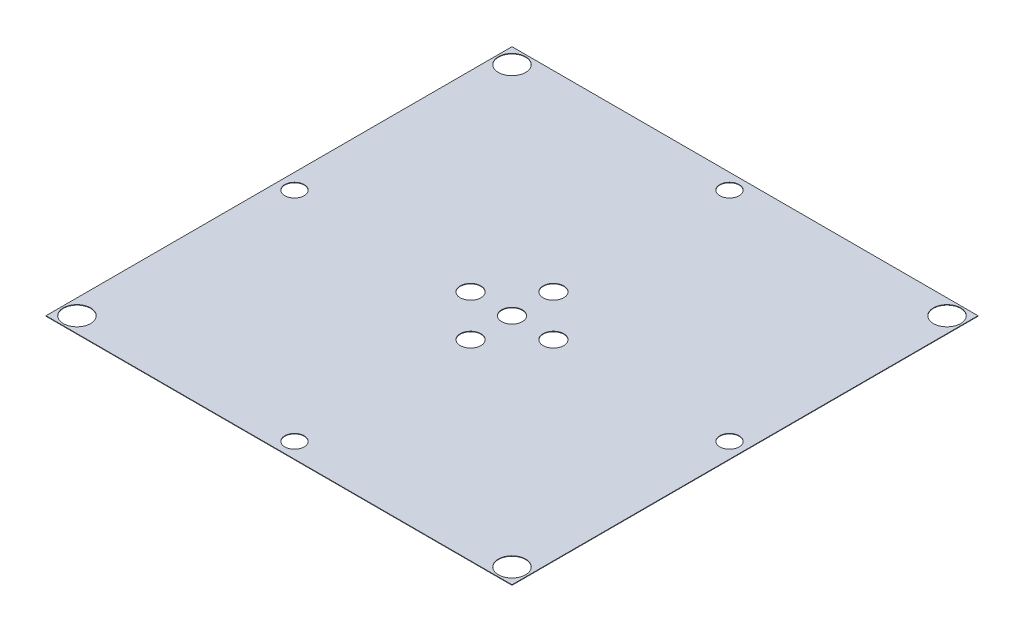
ISO-10303-21;
HEADER;
FILE_DESCRIPTION(('STEP AP214'),'2;1');
FILE_NAME('part.step','',(''),(''),'','','');
FILE_SCHEMA(('AUTOMOTIVE_DESIGN { 1 0 10303 214 1 1 1 1 }'));
ENDSEC;
DATA;
#1=APPLICATION_CONTEXT('core data for automotive mechanical design processes');
#2=APPLICATION_PROTOCOL_DEFINITION('international standard','automotive_design',2000,#1);
#3=PRODUCT_CONTEXT('',#1,'mechanical');
#4=PRODUCT('Part','Part','',(#3));
#5=PRODUCT_RELATED_PRODUCT_CATEGORY('part','',(#4));
#6=PRODUCT_DEFINITION_FORMATION('','',#4);
#7=PRODUCT_DEFINITION_CONTEXT('part definition',#1,'design');
#8=PRODUCT_DEFINITION('design','',#6,#7);
#9=PRODUCT_DEFINITION_SHAPE('','',#8);
#10=(LENGTH_UNIT() NAMED_UNIT(*) SI_UNIT(.MILLI.,.METRE.));
#11=(NAMED_UNIT(*) PLANE_ANGLE_UNIT() SI_UNIT($,.RADIAN.));
#12=(NAMED_UNIT(*) SI_UNIT($,.STERADIAN.) SOLID_ANGLE_UNIT());
#13=UNCERTAINTY_MEASURE_WITH_UNIT(LENGTH_MEASURE(1.E-05),#10,'distance_accuracy_value','');
#14=(GEOMETRIC_REPRESENTATION_CONTEXT(3) GLOBAL_UNCERTAINTY_ASSIGNED_CONTEXT((#13)) GLOBAL_UNIT_ASSIGNED_CONTEXT((#10,
#11,#12)) REPRESENTATION_CONTEXT('',''));
#15=CARTESIAN_POINT('',(0.,0.,0.));
#16=DIRECTION('',(0.,0.,1.));
#17=DIRECTION('',(1.,0.,0.));
#18=AXIS2_PLACEMENT_3D('',#15,#16,#17);
#19=CARTESIAN_POINT('',(-1122.4,2.4,1122.4));
#20=DIRECTION('',(0.,1.,0.));
#21=DIRECTION('',(0.,0.,1.));
#22=AXIS2_PLACEMENT_3D('',#19,#20,#21);
#23=PLANE('',#22);
#24=DIRECTION('',(0.,0.,1.));
#25=VECTOR('',#24,1.);
#26=CARTESIAN_POINT('',(-1124.8,2.40000000000018,-1124.8));
#27=LINE('',#26,#25);
#28=CARTESIAN_POINT('',(-1124.8,2.40000000000018,-1124.8));
#29=VERTEX_POINT('',#28);
#30=CARTESIAN_POINT('',(-1124.8,2.40000000000018,1124.8));
#31=VERTEX_POINT('',#30);
#32=EDGE_CURVE('E83',#29,#31,#27,.T.);
#33=ORIENTED_EDGE('',*,*,#32,.T.);
#34=DIRECTION('',(1.,0.,0.));
#35=VECTOR('',#34,1.);
#36=CARTESIAN_POINT('',(-1124.8,2.40000000000018,1124.8));
#37=LINE('',#36,#35);
#38=CARTESIAN_POINT('',(1124.8,2.40000000000018,1124.8));
#39=VERTEX_POINT('',#38);
#40=EDGE_CURVE('E90',#31,#39,#37,.T.);
#41=ORIENTED_EDGE('',*,*,#40,.T.);
#42=DIRECTION('',(0.,0.,-1.));
#43=VECTOR('',#42,1.);
#44=CARTESIAN_POINT('',(1124.8,2.40000000000018,-1124.8));
#45=LINE('',#44,#43);
#46=CARTESIAN_POINT('',(1124.8,2.40000000000018,-1124.8));
#47=VERTEX_POINT('',#46);
#48=EDGE_CURVE('E95',#39,#47,#45,.T.);
#49=ORIENTED_EDGE('',*,*,#48,.T.);
#50=DIRECTION('',(-1.,0.,0.));
#51=VECTOR('',#50,1.);
#52=CARTESIAN_POINT('',(-1124.8,2.40000000000018,-1124.8));
#53=LINE('',#52,#51);
#54=EDGE_CURVE('E99',#47,#29,#53,.T.);
#55=ORIENTED_EDGE('',*,*,#54,.T.);
#56=EDGE_LOOP('',(#33,#41,#49,#55));
#57=FACE_BOUND('',#56,.T.);
#58=CARTESIAN_POINT('',(7.32747196252603E-12,2.4,1050.));
#59=DIRECTION('',(0.,1.,0.));
#60=DIRECTION('',(0.,0.,1.));
#61=AXIS2_PLACEMENT_3D('',#58,#59,#60);
#62=CIRCLE('',#61,46.7499999999998);
#63=CARTESIAN_POINT('',(7.32747196252603E-12,2.4,1096.75));
#64=VERTEX_POINT('',#63);
#65=EDGE_CURVE('E177',#64,#64,#62,.T.);
#66=ORIENTED_EDGE('',*,*,#65,.F.);
#67=EDGE_LOOP('',(#66));
#68=FACE_BOUND('',#67,.T.);
#69=CARTESIAN_POINT('',(-1050.,2.4,1050.));
#70=DIRECTION('',(0.,1.,0.));
#71=DIRECTION('',(0.,0.,1.));
#72=AXIS2_PLACEMENT_3D('',#69,#70,#71);
#73=CIRCLE('',#72,65.7999999999998);
#74=CARTESIAN_POINT('',(-1050.,2.4,1115.8));
#75=VERTEX_POINT('',#74);
#76=EDGE_CURVE('E174',#75,#75,#73,.T.);
#77=ORIENTED_EDGE('',*,*,#76,.F.);
#78=EDGE_LOOP('',(#77));
#79=FACE_BOUND('',#78,.T.);
#80=CARTESIAN_POINT('',(1050.,2.4,7.4103472100115E-12));
#81=DIRECTION('',(0.,1.,0.));
#82=DIRECTION('',(0.,0.,1.));
#83=AXIS2_PLACEMENT_3D('',#80,#81,#82);
#84=CIRCLE('',#83,46.7499999999998);
#85=CARTESIAN_POINT('',(1050.,2.4,46.7500000000072));
#86=VERTEX_POINT('',#85);
#87=EDGE_CURVE('E171',#86,#86,#84,.T.);
#88=ORIENTED_EDGE('',*,*,#87,.F.);
#89=EDGE_LOOP('',(#88));
#90=FACE_BOUND('',#89,.T.);
#91=CARTESIAN_POINT('',(200.,2.4,1.39659253553725E-12));
#92=DIRECTION('',(0.,1.,0.));
#93=DIRECTION('',(0.,0.,1.));
#94=AXIS2_PLACEMENT_3D('',#91,#92,#93);
#95=CIRCLE('',#94,49.85);
#96=CARTESIAN_POINT('',(200.,2.4,49.8500000000014));
#97=VERTEX_POINT('',#96);
#98=EDGE_CURVE('E168',#97,#97,#95,.T.);
#99=ORIENTED_EDGE('',*,*,#98,.F.);
#100=EDGE_LOOP('',(#99));
#101=FACE_BOUND('',#100,.T.);
#102=CARTESIAN_POINT('',(1050.,2.4,-1050.));
#103=DIRECTION('',(0.,1.,0.));
#104=DIRECTION('',(0.,0.,1.));
#105=AXIS2_PLACEMENT_3D('',#102,#103,#104);
#106=CIRCLE('',#105,65.8);
#107=CARTESIAN_POINT('',(1050.,2.4,-984.2));
#108=VERTEX_POINT('',#107);
#109=EDGE_CURVE('E165',#108,#108,#106,.T.);
#110=ORIENTED_EDGE('',*,*,#109,.F.);
#111=EDGE_LOOP('',(#110));
#112=FACE_BOUND('',#111,.T.);
#113=CARTESIAN_POINT('',(-1050.,2.4,-1050.));
#114=DIRECTION('',(0.,1.,0.));
#115=DIRECTION('',(0.,0.,1.));
#116=AXIS2_PLACEMENT_3D('',#113,#114,#115);
#117=CIRCLE('',#116,65.8);
#118=CARTESIAN_POINT('',(-1050.,2.4,-984.2));
#119=VERTEX_POINT('',#118);
#120=EDGE_CURVE('E162',#119,#119,#117,.T.);
#121=ORIENTED_EDGE('',*,*,#120,.F.);
#122=EDGE_LOOP('',(#121));
#123=FACE_BOUND('',#122,.T.);
#124=CARTESIAN_POINT('',(-200.,2.4,1.39659253553725E-12));
#125=DIRECTION('',(0.,1.,0.));
#126=DIRECTION('',(0.,0.,1.));
#127=AXIS2_PLACEMENT_3D('',#124,#125,#126);
#128=CIRCLE('',#127,49.85);
#129=CARTESIAN_POINT('',(-200.,2.4,49.8500000000014));
#130=VERTEX_POINT('',#129);
#131=EDGE_CURVE('E159',#130,#130,#128,.T.);
#132=ORIENTED_EDGE('',*,*,#131,.F.);
#133=EDGE_LOOP('',(#132));
#134=FACE_BOUND('',#133,.T.);
#135=CARTESIAN_POINT('',(-1050.,2.4,7.85443641986157E-12));
#136=DIRECTION('',(0.,1.,0.));
#137=DIRECTION('',(0.,0.,1.));
#138=AXIS2_PLACEMENT_3D('',#135,#136,#137);
#139=CIRCLE('',#138,46.7499999999998);
#140=CARTESIAN_POINT('',(-1050.,2.4,46.7500000000077));
#141=VERTEX_POINT('',#140);
#142=EDGE_CURVE('E156',#141,#141,#139,.T.);
#143=ORIENTED_EDGE('',*,*,#142,.F.);
#144=EDGE_LOOP('',(#143));
#145=FACE_BOUND('',#144,.T.);
#146=CARTESIAN_POINT('',(1050.,2.4,1050.));
#147=DIRECTION('',(0.,1.,0.));
#148=DIRECTION('',(0.,0.,1.));
#149=AXIS2_PLACEMENT_3D('',#146,#147,#148);
#150=CIRCLE('',#149,65.7999999999998);
#151=CARTESIAN_POINT('',(1050.,2.4,1115.8));
#152=VERTEX_POINT('',#151);
#153=EDGE_CURVE('E153',#152,#152,#150,.T.);
#154=ORIENTED_EDGE('',*,*,#153,.F.);
#155=EDGE_LOOP('',(#154));
#156=FACE_BOUND('',#155,.T.);
#157=CARTESIAN_POINT('',(7.54951656745106E-12,2.4,-1050.));
#158=DIRECTION('',(0.,1.,0.));
#159=DIRECTION('',(0.,0.,1.));
#160=AXIS2_PLACEMENT_3D('',#157,#158,#159);
#161=CIRCLE('',#160,46.7499999999998);
#162=CARTESIAN_POINT('',(7.54951656745106E-12,2.4,-1003.25));
#163=VERTEX_POINT('',#162);
#164=EDGE_CURVE('E150',#163,#163,#161,.T.);
#165=ORIENTED_EDGE('',*,*,#164,.F.);
#166=EDGE_LOOP('',(#165));
#167=FACE_BOUND('',#166,.T.);
#168=CARTESIAN_POINT('',(1.0547118733939E-12,2.4,-200.));
#169=DIRECTION('',(0.,1.,0.));
#170=DIRECTION('',(0.,0.,1.));
#171=AXIS2_PLACEMENT_3D('',#168,#169,#170);
#172=CIRCLE('',#171,49.8499999999995);
#173=CARTESIAN_POINT('',(1.0547118733939E-12,2.4,-150.15));
#174=VERTEX_POINT('',#173);
#175=EDGE_CURVE('E147',#174,#174,#172,.T.);
#176=ORIENTED_EDGE('',*,*,#175,.F.);
#177=EDGE_LOOP('',(#176));
#178=FACE_BOUND('',#177,.T.);
#179=CARTESIAN_POINT('',(1.16573417585641E-12,2.4,200.));
#180=DIRECTION('',(0.,1.,0.));
#181=DIRECTION('',(0.,0.,1.));
#182=AXIS2_PLACEMENT_3D('',#179,#180,#181);
#183=CIRCLE('',#182,49.8499999999997);
#184=CARTESIAN_POINT('',(1.16573417585641E-12,2.4,249.849999999999));
#185=VERTEX_POINT('',#184);
#186=EDGE_CURVE('E144',#185,#185,#183,.T.);
#187=ORIENTED_EDGE('',*,*,#186,.F.);
#188=EDGE_LOOP('',(#187));
#189=FACE_BOUND('',#188,.T.);
#190=CARTESIAN_POINT('',(0.,2.4,0.));
#191=DIRECTION('',(0.,1.,0.));
#192=DIRECTION('',(0.,0.,1.));
#193=AXIS2_PLACEMENT_3D('',#190,#191,#192);
#194=CIRCLE('',#193,49.85);
#195=CARTESIAN_POINT('',(0.,2.4,49.85));
#196=VERTEX_POINT('',#195);
#197=EDGE_CURVE('E141',#196,#196,#194,.T.);
#198=ORIENTED_EDGE('',*,*,#197,.F.);
#199=EDGE_LOOP('',(#198));
#200=FACE_BOUND('',#199,.T.);
#201=ADVANCED_FACE('F38',(#57,#68,#79,#90,#101,#112,#123,#134,#145,#156,#167,#178,#189,#200),
#23,.T.);
#202=CARTESIAN_POINT('',(1124.8,2249.6,-1124.8));
#203=DIRECTION('',(-1.,0.,0.));
#204=DIRECTION('',(0.,0.,1.));
#205=AXIS2_PLACEMENT_3D('',#202,#203,#204);
#206=PLANE('',#205);
#207=ORIENTED_EDGE('',*,*,#48,.F.);
#208=DIRECTION('',(0.,-1.,0.));
#209=VECTOR('',#208,1.);
#210=CARTESIAN_POINT('',(1124.8,2249.6,1124.8));
#211=LINE('',#210,#209);
#212=CARTESIAN_POINT('',(1124.8,0.,1124.8));
#213=VERTEX_POINT('',#212);
#214=EDGE_CURVE('E42',#39,#213,#211,.T.);
#215=ORIENTED_EDGE('',*,*,#214,.T.);
#216=DIRECTION('',(0.,0.,-1.));
#217=VECTOR('',#216,1.);
#218=CARTESIAN_POINT('',(1124.8,0.,-1124.8));
#219=LINE('',#218,#217);
#220=CARTESIAN_POINT('',(1124.8,0.,-1124.8));
#221=VERTEX_POINT('',#220);
#222=EDGE_CURVE('E180',#213,#221,#219,.T.);
#223=ORIENTED_EDGE('',*,*,#222,.T.);
#224=DIRECTION('',(0.,-1.,0.));
#225=VECTOR('',#224,1.);
#226=CARTESIAN_POINT('',(1124.8,2249.6,-1124.8));
#227=LINE('',#226,#225);
#228=EDGE_CURVE('E55',#47,#221,#227,.T.);
#229=ORIENTED_EDGE('',*,*,#228,.F.);
#230=EDGE_LOOP('',(#207,#215,#223,#229));
#231=FACE_BOUND('',#230,.T.);
#232=ADVANCED_FACE('F188',(#231),#206,.F.);
#233=CARTESIAN_POINT('',(-1124.8,2249.6,1124.8));
#234=DIRECTION('',(0.,0.,-1.));
#235=DIRECTION('',(-1.,0.,0.));
#236=AXIS2_PLACEMENT_3D('',#233,#234,#235);
#237=PLANE('',#236);
#238=ORIENTED_EDGE('',*,*,#40,.F.);
#239=DIRECTION('',(0.,-1.,0.));
#240=VECTOR('',#239,1.);
#241=CARTESIAN_POINT('',(-1124.8,2249.6,1124.8));
#242=LINE('',#241,#240);
#243=CARTESIAN_POINT('',(-1124.8,0.,1124.8));
#244=VERTEX_POINT('',#243);
#245=EDGE_CURVE('E79',#31,#244,#242,.T.);
#246=ORIENTED_EDGE('',*,*,#245,.T.);
#247=DIRECTION('',(1.,0.,0.));
#248=VECTOR('',#247,1.);
#249=CARTESIAN_POINT('',(-1124.8,0.,1124.8));
#250=LINE('',#249,#248);
#251=EDGE_CURVE('E185',#244,#213,#250,.T.);
#252=ORIENTED_EDGE('',*,*,#251,.T.);
#253=ORIENTED_EDGE('',*,*,#214,.F.);
#254=EDGE_LOOP('',(#238,#246,#252,#253));
#255=FACE_BOUND('',#254,.T.);
#256=ADVANCED_FACE('F91',(#255),#237,.F.);
#257=CARTESIAN_POINT('',(0.,0.,0.));
#258=DIRECTION('',(0.,1.,0.));
#259=DIRECTION('',(0.,0.,1.));
#260=AXIS2_PLACEMENT_3D('',#257,#258,#259);
#261=PLANE('',#260);
#262=CARTESIAN_POINT('',(7.32747196252603E-12,0.,1050.));
#263=DIRECTION('',(0.,1.,0.));
#264=DIRECTION('',(0.,0.,1.));
#265=AXIS2_PLACEMENT_3D('',#262,#263,#264);
#266=CIRCLE('',#265,46.7499999999998);
#267=CARTESIAN_POINT('',(7.32747196252603E-12,0.,1096.75));
#268=VERTEX_POINT('',#267);
#269=EDGE_CURVE('E112',#268,#268,#266,.T.);
#270=ORIENTED_EDGE('',*,*,#269,.T.);
#271=EDGE_LOOP('',(#270));
#272=FACE_BOUND('',#271,.T.);
#273=CARTESIAN_POINT('',(-1050.,0.,1050.));
#274=DIRECTION('',(0.,1.,0.));
#275=DIRECTION('',(0.,0.,1.));
#276=AXIS2_PLACEMENT_3D('',#273,#274,#275);
#277=CIRCLE('',#276,65.7999999999998);
#278=CARTESIAN_POINT('',(-1050.,0.,1115.8));
#279=VERTEX_POINT('',#278);
#280=EDGE_CURVE('E122',#279,#279,#277,.T.);
#281=ORIENTED_EDGE('',*,*,#280,.T.);
#282=EDGE_LOOP('',(#281));
#283=FACE_BOUND('',#282,.T.);
#284=CARTESIAN_POINT('',(1050.,0.,7.4103472100115E-12));
#285=DIRECTION('',(0.,1.,0.));
#286=DIRECTION('',(0.,0.,-1.));
#287=AXIS2_PLACEMENT_3D('',#284,#285,#286);
#288=CIRCLE('',#287,46.7499999999998);
#289=CARTESIAN_POINT('',(1050.,0.,-46.7499999999924));
#290=VERTEX_POINT('',#289);
#291=EDGE_CURVE('E118',#290,#290,#288,.T.);
#292=ORIENTED_EDGE('',*,*,#291,.T.);
#293=EDGE_LOOP('',(#292));
#294=FACE_BOUND('',#293,.T.);
#295=CARTESIAN_POINT('',(200.,0.,1.39659253553725E-12));
#296=DIRECTION('',(0.,1.,0.));
#297=DIRECTION('',(0.,0.,-1.));
#298=AXIS2_PLACEMENT_3D('',#295,#296,#297);
#299=CIRCLE('',#298,49.85);
#300=CARTESIAN_POINT('',(200.,0.,-49.8499999999986));
#301=VERTEX_POINT('',#300);
#302=EDGE_CURVE('E115',#301,#301,#299,.T.);
#303=ORIENTED_EDGE('',*,*,#302,.T.);
#304=EDGE_LOOP('',(#303));
#305=FACE_BOUND('',#304,.T.);
#306=CARTESIAN_POINT('',(1050.,0.,-1050.));
#307=DIRECTION('',(0.,1.,0.));
#308=DIRECTION('',(0.,0.,-1.));
#309=AXIS2_PLACEMENT_3D('',#306,#307,#308);
#310=CIRCLE('',#309,65.8);
#311=CARTESIAN_POINT('',(1050.,0.,-1115.8));
#312=VERTEX_POINT('',#311);
#313=EDGE_CURVE('E119',#312,#312,#310,.T.);
#314=ORIENTED_EDGE('',*,*,#313,.T.);
#315=EDGE_LOOP('',(#314));
#316=FACE_BOUND('',#315,.T.);
#317=CARTESIAN_POINT('',(-1050.,0.,-1050.));
#318=DIRECTION('',(0.,1.,0.));
#319=DIRECTION('',(0.,0.,1.));
#320=AXIS2_PLACEMENT_3D('',#317,#318,#319);
#321=CIRCLE('',#320,65.8);
#322=CARTESIAN_POINT('',(-1050.,0.,-984.2));
#323=VERTEX_POINT('',#322);
#324=EDGE_CURVE('E134',#323,#323,#321,.T.);
#325=ORIENTED_EDGE('',*,*,#324,.T.);
#326=EDGE_LOOP('',(#325));
#327=FACE_BOUND('',#326,.T.);
#328=CARTESIAN_POINT('',(-200.,0.,1.39659253553725E-12));
#329=DIRECTION('',(0.,1.,0.));
#330=DIRECTION('',(0.,0.,1.));
#331=AXIS2_PLACEMENT_3D('',#328,#329,#330);
#332=CIRCLE('',#331,49.85);
#333=CARTESIAN_POINT('',(-200.,0.,49.8500000000014));
#334=VERTEX_POINT('',#333);
#335=EDGE_CURVE('E130',#334,#334,#332,.T.);
#336=ORIENTED_EDGE('',*,*,#335,.T.);
#337=EDGE_LOOP('',(#336));
#338=FACE_BOUND('',#337,.T.);
#339=CARTESIAN_POINT('',(-1050.,0.,7.85443641986157E-12));
#340=DIRECTION('',(0.,1.,0.));
#341=DIRECTION('',(0.,0.,1.));
#342=AXIS2_PLACEMENT_3D('',#339,#340,#341);
#343=CIRCLE('',#342,46.7499999999998);
#344=CARTESIAN_POINT('',(-1050.,0.,46.7500000000077));
#345=VERTEX_POINT('',#344);
#346=EDGE_CURVE('E127',#345,#345,#343,.T.);
#347=ORIENTED_EDGE('',*,*,#346,.T.);
#348=EDGE_LOOP('',(#347));
#349=FACE_BOUND('',#348,.T.);
#350=CARTESIAN_POINT('',(1050.,0.,1050.));
#351=DIRECTION('',(0.,1.,0.));
#352=DIRECTION('',(0.,0.,-1.));
#353=AXIS2_PLACEMENT_3D('',#350,#351,#352);
#354=CIRCLE('',#353,65.7999999999998);
#355=CARTESIAN_POINT('',(1050.,0.,984.2));
#356=VERTEX_POINT('',#355);
#357=EDGE_CURVE('E11',#356,#356,#354,.T.);
#358=ORIENTED_EDGE('',*,*,#357,.T.);
#359=EDGE_LOOP('',(#358));
#360=FACE_BOUND('',#359,.T.);
#361=CARTESIAN_POINT('',(7.54951656745106E-12,0.,-1050.));
#362=DIRECTION('',(0.,1.,0.));
#363=DIRECTION('',(0.,0.,-1.));
#364=AXIS2_PLACEMENT_3D('',#361,#362,#363);
#365=CIRCLE('',#364,46.7499999999998);
#366=CARTESIAN_POINT('',(7.54951656745106E-12,0.,-1096.75));
#367=VERTEX_POINT('',#366);
#368=EDGE_CURVE('E47',#367,#367,#365,.T.);
#369=ORIENTED_EDGE('',*,*,#368,.T.);
#370=EDGE_LOOP('',(#369));
#371=FACE_BOUND('',#370,.T.);
#372=CARTESIAN_POINT('',(1.0547118733939E-12,0.,-200.));
#373=DIRECTION('',(0.,1.,0.));
#374=DIRECTION('',(0.,0.,-1.));
#375=AXIS2_PLACEMENT_3D('',#372,#373,#374);
#376=CIRCLE('',#375,49.8499999999995);
#377=CARTESIAN_POINT('',(1.0547118733939E-12,0.,-249.849999999999));
#378=VERTEX_POINT('',#377);
#379=EDGE_CURVE('E107',#378,#378,#376,.T.);
#380=ORIENTED_EDGE('',*,*,#379,.T.);
#381=EDGE_LOOP('',(#380));
#382=FACE_BOUND('',#381,.T.);
#383=CARTESIAN_POINT('',(1.16573417585641E-12,0.,200.));
#384=DIRECTION('',(0.,1.,0.));
#385=DIRECTION('',(0.,0.,1.));
#386=AXIS2_PLACEMENT_3D('',#383,#384,#385);
#387=CIRCLE('',#386,49.8499999999997);
#388=CARTESIAN_POINT('',(1.16573417585641E-12,0.,249.849999999999));
#389=VERTEX_POINT('',#388);
#390=EDGE_CURVE('E109',#389,#389,#387,.T.);
#391=ORIENTED_EDGE('',*,*,#390,.T.);
#392=EDGE_LOOP('',(#391));
#393=FACE_BOUND('',#392,.T.);
#394=CARTESIAN_POINT('',(0.,0.,0.));
#395=DIRECTION('',(0.,1.,0.));
#396=DIRECTION('',(0.,0.,1.));
#397=AXIS2_PLACEMENT_3D('',#394,#395,#396);
#398=CIRCLE('',#397,49.85);
#399=CARTESIAN_POINT('',(0.,0.,49.85));
#400=VERTEX_POINT('',#399);
#401=EDGE_CURVE('E131',#400,#400,#398,.T.);
#402=ORIENTED_EDGE('',*,*,#401,.T.);
#403=EDGE_LOOP('',(#402));
#404=FACE_BOUND('',#403,.T.);
#405=ORIENTED_EDGE('',*,*,#251,.F.);
#406=DIRECTION('',(0.,0.,1.));
#407=VECTOR('',#406,1.);
#408=CARTESIAN_POINT('',(-1124.8,0.,-1124.8));
#409=LINE('',#408,#407);
#410=CARTESIAN_POINT('',(-1124.8,0.,-1124.8));
#411=VERTEX_POINT('',#410);
#412=EDGE_CURVE('E85',#411,#244,#409,.T.);
#413=ORIENTED_EDGE('',*,*,#412,.F.);
#414=DIRECTION('',(-1.,0.,0.));
#415=VECTOR('',#414,1.);
#416=CARTESIAN_POINT('',(-1124.8,0.,-1124.8));
#417=LINE('',#416,#415);
#418=EDGE_CURVE('E182',#221,#411,#417,.T.);
#419=ORIENTED_EDGE('',*,*,#418,.F.);
#420=ORIENTED_EDGE('',*,*,#222,.F.);
#421=EDGE_LOOP('',(#405,#413,#419,#420));
#422=FACE_BOUND('',#421,.T.);
#423=ADVANCED_FACE('F192',(#272,#283,#294,#305,#316,#327,#338,#349,#360,#371,#382,#393,#404,
#422),#261,.F.);
#424=CARTESIAN_POINT('',(7.32747196252603E-12,0.,1050.));
#425=DIRECTION('',(0.,1.,0.));
#426=DIRECTION('',(0.,0.,1.));
#427=AXIS2_PLACEMENT_3D('',#424,#425,#426);
#428=CYLINDRICAL_SURFACE('',#427,46.7499999999998);
#429=ORIENTED_EDGE('',*,*,#65,.T.);
#430=EDGE_LOOP('',(#429));
#431=FACE_BOUND('',#430,.T.);
#432=ORIENTED_EDGE('',*,*,#269,.F.);
#433=EDGE_LOOP('',(#432));
#434=FACE_BOUND('',#433,.T.);
#435=ADVANCED_FACE('F40',(#431,#434),#428,.F.);
#436=CARTESIAN_POINT('',(-1050.,0.,1050.));
#437=DIRECTION('',(0.,1.,0.));
#438=DIRECTION('',(0.,0.,1.));
#439=AXIS2_PLACEMENT_3D('',#436,#437,#438);
#440=CYLINDRICAL_SURFACE('',#439,65.7999999999998);
#441=ORIENTED_EDGE('',*,*,#76,.T.);
#442=EDGE_LOOP('',(#441));
#443=FACE_BOUND('',#442,.T.);
#444=ORIENTED_EDGE('',*,*,#280,.F.);
#445=EDGE_LOOP('',(#444));
#446=FACE_BOUND('',#445,.T.);
#447=ADVANCED_FACE('F200',(#443,#446),#440,.F.);
#448=CARTESIAN_POINT('',(1050.,0.,7.4103472100115E-12));
#449=DIRECTION('',(0.,1.,0.));
#450=DIRECTION('',(0.,0.,1.));
#451=AXIS2_PLACEMENT_3D('',#448,#449,#450);
#452=CYLINDRICAL_SURFACE('',#451,46.7499999999998);
#453=ORIENTED_EDGE('',*,*,#87,.T.);
#454=EDGE_LOOP('',(#453));
#455=FACE_BOUND('',#454,.T.);
#456=ORIENTED_EDGE('',*,*,#291,.F.);
#457=EDGE_LOOP('',(#456));
#458=FACE_BOUND('',#457,.T.);
#459=ADVANCED_FACE('F255',(#455,#458),#452,.F.);
#460=CARTESIAN_POINT('',(200.,0.,1.39659253553725E-12));
#461=DIRECTION('',(0.,1.,0.));
#462=DIRECTION('',(0.,0.,1.));
#463=AXIS2_PLACEMENT_3D('',#460,#461,#462);
#464=CYLINDRICAL_SURFACE('',#463,49.85);
#465=ORIENTED_EDGE('',*,*,#98,.T.);
#466=EDGE_LOOP('',(#465));
#467=FACE_BOUND('',#466,.T.);
#468=ORIENTED_EDGE('',*,*,#302,.F.);
#469=EDGE_LOOP('',(#468));
#470=FACE_BOUND('',#469,.T.);
#471=ADVANCED_FACE('F251',(#467,#470),#464,.F.);
#472=CARTESIAN_POINT('',(1050.,0.,-1050.));
#473=DIRECTION('',(0.,1.,0.));
#474=DIRECTION('',(0.,0.,1.));
#475=AXIS2_PLACEMENT_3D('',#472,#473,#474);
#476=CYLINDRICAL_SURFACE('',#475,65.8);
#477=ORIENTED_EDGE('',*,*,#109,.T.);
#478=EDGE_LOOP('',(#477));
#479=FACE_BOUND('',#478,.T.);
#480=ORIENTED_EDGE('',*,*,#313,.F.);
#481=EDGE_LOOP('',(#480));
#482=FACE_BOUND('',#481,.T.);
#483=ADVANCED_FACE('F247',(#479,#482),#476,.F.);
#484=CARTESIAN_POINT('',(-1050.,0.,-1050.));
#485=DIRECTION('',(0.,1.,0.));
#486=DIRECTION('',(0.,0.,1.));
#487=AXIS2_PLACEMENT_3D('',#484,#485,#486);
#488=CYLINDRICAL_SURFACE('',#487,65.8);
#489=ORIENTED_EDGE('',*,*,#120,.T.);
#490=EDGE_LOOP('',(#489));
#491=FACE_BOUND('',#490,.T.);
#492=ORIENTED_EDGE('',*,*,#324,.F.);
#493=EDGE_LOOP('',(#492));
#494=FACE_BOUND('',#493,.T.);
#495=ADVANCED_FACE('F243',(#491,#494),#488,.F.);
#496=CARTESIAN_POINT('',(-200.,0.,1.39659253553725E-12));
#497=DIRECTION('',(0.,1.,0.));
#498=DIRECTION('',(0.,0.,1.));
#499=AXIS2_PLACEMENT_3D('',#496,#497,#498);
#500=CYLINDRICAL_SURFACE('',#499,49.85);
#501=ORIENTED_EDGE('',*,*,#131,.T.);
#502=EDGE_LOOP('',(#501));
#503=FACE_BOUND('',#502,.T.);
#504=ORIENTED_EDGE('',*,*,#335,.F.);
#505=EDGE_LOOP('',(#504));
#506=FACE_BOUND('',#505,.T.);
#507=ADVANCED_FACE('F239',(#503,#506),#500,.F.);
#508=CARTESIAN_POINT('',(-1050.,0.,7.85443641986157E-12));
#509=DIRECTION('',(0.,1.,0.));
#510=DIRECTION('',(0.,0.,1.));
#511=AXIS2_PLACEMENT_3D('',#508,#509,#510);
#512=CYLINDRICAL_SURFACE('',#511,46.7499999999998);
#513=ORIENTED_EDGE('',*,*,#142,.T.);
#514=EDGE_LOOP('',(#513));
#515=FACE_BOUND('',#514,.T.);
#516=ORIENTED_EDGE('',*,*,#346,.F.);
#517=EDGE_LOOP('',(#516));
#518=FACE_BOUND('',#517,.T.);
#519=ADVANCED_FACE('F235',(#515,#518),#512,.F.);
#520=CARTESIAN_POINT('',(1050.,0.,1050.));
#521=DIRECTION('',(0.,1.,0.));
#522=DIRECTION('',(0.,0.,1.));
#523=AXIS2_PLACEMENT_3D('',#520,#521,#522);
#524=CYLINDRICAL_SURFACE('',#523,65.7999999999998);
#525=ORIENTED_EDGE('',*,*,#153,.T.);
#526=EDGE_LOOP('',(#525));
#527=FACE_BOUND('',#526,.T.);
#528=ORIENTED_EDGE('',*,*,#357,.F.);
#529=EDGE_LOOP('',(#528));
#530=FACE_BOUND('',#529,.T.);
#531=ADVANCED_FACE('F231',(#527,#530),#524,.F.);
#532=CARTESIAN_POINT('',(7.54951656745106E-12,0.,-1050.));
#533=DIRECTION('',(0.,1.,0.));
#534=DIRECTION('',(0.,0.,1.));
#535=AXIS2_PLACEMENT_3D('',#532,#533,#534);
#536=CYLINDRICAL_SURFACE('',#535,46.7499999999998);
#537=ORIENTED_EDGE('',*,*,#164,.T.);
#538=EDGE_LOOP('',(#537));
#539=FACE_BOUND('',#538,.T.);
#540=ORIENTED_EDGE('',*,*,#368,.F.);
#541=EDGE_LOOP('',(#540));
#542=FACE_BOUND('',#541,.T.);
#543=ADVANCED_FACE('F227',(#539,#542),#536,.F.);
#544=CARTESIAN_POINT('',(1.0547118733939E-12,0.,-200.));
#545=DIRECTION('',(0.,1.,0.));
#546=DIRECTION('',(0.,0.,1.));
#547=AXIS2_PLACEMENT_3D('',#544,#545,#546);
#548=CYLINDRICAL_SURFACE('',#547,49.8499999999995);
#549=ORIENTED_EDGE('',*,*,#175,.T.);
#550=EDGE_LOOP('',(#549));
#551=FACE_BOUND('',#550,.T.);
#552=ORIENTED_EDGE('',*,*,#379,.F.);
#553=EDGE_LOOP('',(#552));
#554=FACE_BOUND('',#553,.T.);
#555=ADVANCED_FACE('F223',(#551,#554),#548,.F.);
#556=CARTESIAN_POINT('',(1.16573417585641E-12,0.,200.));
#557=DIRECTION('',(0.,1.,0.));
#558=DIRECTION('',(0.,0.,1.));
#559=AXIS2_PLACEMENT_3D('',#556,#557,#558);
#560=CYLINDRICAL_SURFACE('',#559,49.8499999999997);
#561=ORIENTED_EDGE('',*,*,#186,.T.);
#562=EDGE_LOOP('',(#561));
#563=FACE_BOUND('',#562,.T.);
#564=ORIENTED_EDGE('',*,*,#390,.F.);
#565=EDGE_LOOP('',(#564));
#566=FACE_BOUND('',#565,.T.);
#567=ADVANCED_FACE('F219',(#563,#566),#560,.F.);
#568=CARTESIAN_POINT('',(0.,0.,0.));
#569=DIRECTION('',(0.,1.,0.));
#570=DIRECTION('',(0.,0.,1.));
#571=AXIS2_PLACEMENT_3D('',#568,#569,#570);
#572=CYLINDRICAL_SURFACE('',#571,49.85);
#573=ORIENTED_EDGE('',*,*,#197,.T.);
#574=EDGE_LOOP('',(#573));
#575=FACE_BOUND('',#574,.T.);
#576=ORIENTED_EDGE('',*,*,#401,.F.);
#577=EDGE_LOOP('',(#576));
#578=FACE_BOUND('',#577,.T.);
#579=ADVANCED_FACE('F214',(#575,#578),#572,.F.);
#580=CARTESIAN_POINT('',(-1124.8,2249.6,-1124.8));
#581=DIRECTION('',(0.,0.,1.));
#582=DIRECTION('',(1.,0.,0.));
#583=AXIS2_PLACEMENT_3D('',#580,#581,#582);
#584=PLANE('',#583);
#585=ORIENTED_EDGE('',*,*,#54,.F.);
#586=ORIENTED_EDGE('',*,*,#228,.T.);
#587=ORIENTED_EDGE('',*,*,#418,.T.);
#588=DIRECTION('',(0.,-1.,0.));
#589=VECTOR('',#588,1.);
#590=CARTESIAN_POINT('',(-1124.8,2249.6,-1124.8));
#591=LINE('',#590,#589);
#592=EDGE_CURVE('E63',#29,#411,#591,.T.);
#593=ORIENTED_EDGE('',*,*,#592,.F.);
#594=EDGE_LOOP('',(#585,#586,#587,#593));
#595=FACE_BOUND('',#594,.T.);
#596=ADVANCED_FACE('F190',(#595),#584,.F.);
#597=CARTESIAN_POINT('',(-1124.8,2249.6,-1124.8));
#598=DIRECTION('',(1.,0.,0.));
#599=DIRECTION('',(0.,0.,-1.));
#600=AXIS2_PLACEMENT_3D('',#597,#598,#599);
#601=PLANE('',#600);
#602=ORIENTED_EDGE('',*,*,#32,.F.);
#603=ORIENTED_EDGE('',*,*,#592,.T.);
#604=ORIENTED_EDGE('',*,*,#412,.T.);
#605=ORIENTED_EDGE('',*,*,#245,.F.);
#606=EDGE_LOOP('',(#602,#603,#604,#605));
#607=FACE_BOUND('',#606,.T.);
#608=ADVANCED_FACE('F81',(#607),#601,.F.);
#609=CLOSED_SHELL('',(#201,#232,#256,#423,#435,#447,#459,#471,#483,#495,#507,#519,#531,#543,
#555,#567,#579,#596,#608));
#610=MANIFOLD_SOLID_BREP('B2',#609);
#611=ADVANCED_BREP_SHAPE_REPRESENTATION('',(#18,#610),#14);
#612=SHAPE_DEFINITION_REPRESENTATION(#9,#611);
ENDSEC;
END-ISO-10303-21;
